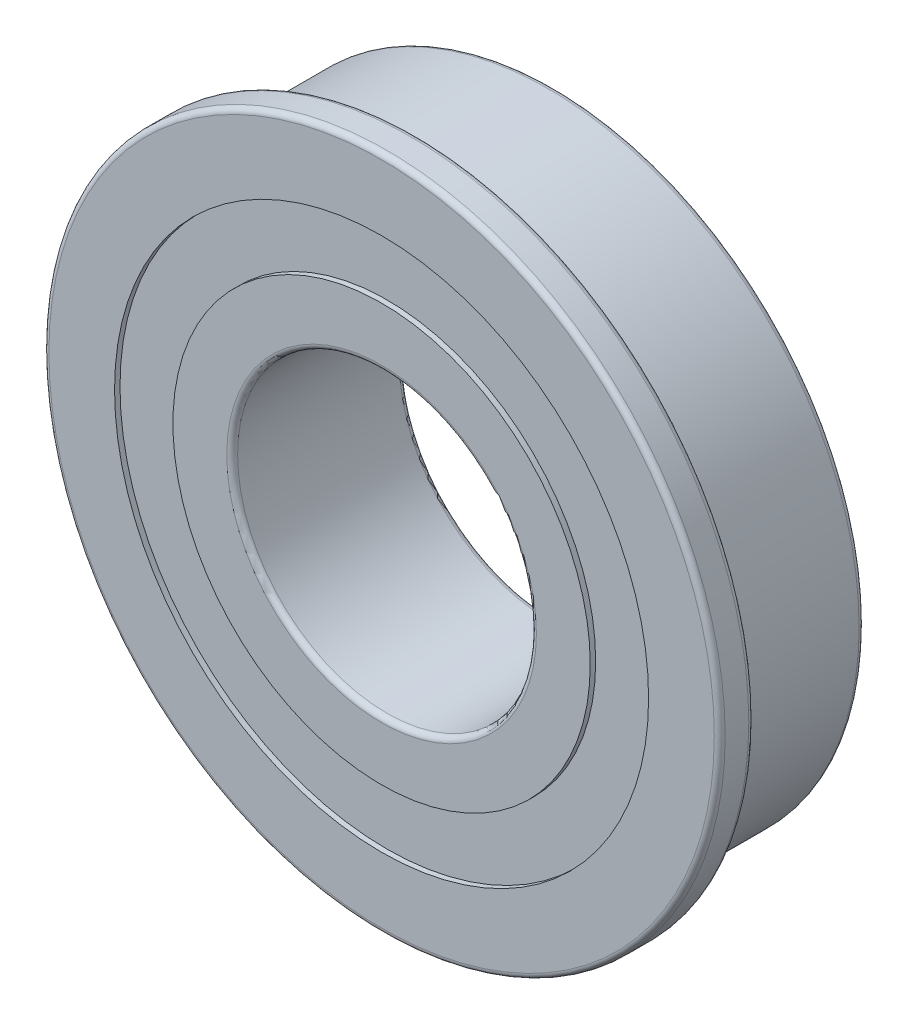
ISO-10303-21;
HEADER;
FILE_DESCRIPTION(('STEP AP214'),'2;1');
FILE_NAME('part.step','',(''),(''),'','','');
FILE_SCHEMA(('AUTOMOTIVE_DESIGN { 1 0 10303 214 1 1 1 1 }'));
ENDSEC;
DATA;
#1=APPLICATION_CONTEXT('core data for automotive mechanical design processes');
#2=APPLICATION_PROTOCOL_DEFINITION('international standard','automotive_design',2000,#1);
#3=PRODUCT_CONTEXT('',#1,'mechanical');
#4=PRODUCT('Part','Part','',(#3));
#5=PRODUCT_RELATED_PRODUCT_CATEGORY('part','',(#4));
#6=PRODUCT_DEFINITION_FORMATION('','',#4);
#7=PRODUCT_DEFINITION_CONTEXT('part definition',#1,'design');
#8=PRODUCT_DEFINITION('design','',#6,#7);
#9=PRODUCT_DEFINITION_SHAPE('','',#8);
#10=(LENGTH_UNIT() NAMED_UNIT(*) SI_UNIT(.MILLI.,.METRE.));
#11=(NAMED_UNIT(*) PLANE_ANGLE_UNIT() SI_UNIT($,.RADIAN.));
#12=(NAMED_UNIT(*) SI_UNIT($,.STERADIAN.) SOLID_ANGLE_UNIT());
#13=UNCERTAINTY_MEASURE_WITH_UNIT(LENGTH_MEASURE(1.E-05),#10,'distance_accuracy_value','');
#14=(GEOMETRIC_REPRESENTATION_CONTEXT(3) GLOBAL_UNCERTAINTY_ASSIGNED_CONTEXT((#13)) GLOBAL_UNIT_ASSIGNED_CONTEXT((#10,
#11,#12)) REPRESENTATION_CONTEXT('',''));
#15=CARTESIAN_POINT('',(0.,0.,0.));
#16=DIRECTION('',(0.,0.,1.));
#17=DIRECTION('',(1.,0.,0.));
#18=AXIS2_PLACEMENT_3D('',#15,#16,#17);
#19=CARTESIAN_POINT('',(0.,0.,53.2489151398028));
#20=DIRECTION('',(0.,0.,1.));
#21=DIRECTION('',(1.,0.,0.));
#22=AXIS2_PLACEMENT_3D('',#19,#20,#21);
#23=CYLINDRICAL_SURFACE('',#22,12.2875000000004);
#24=CARTESIAN_POINT('',(0.,0.,-3.718750000001));
#25=DIRECTION('',(0.,0.,1.));
#26=DIRECTION('',(1.,0.,0.));
#27=AXIS2_PLACEMENT_3D('',#24,#25,#26);
#28=CIRCLE('',#27,12.2875000000004);
#29=CARTESIAN_POINT('',(12.2875000000004,0.,-3.718750000001));
#30=VERTEX_POINT('',#29);
#31=EDGE_CURVE('E83',#30,#30,#28,.T.);
#32=ORIENTED_EDGE('',*,*,#31,.T.);
#33=EDGE_LOOP('',(#32));
#34=FACE_BOUND('',#33,.T.);
#35=CARTESIAN_POINT('',(0.,0.,-3.96875));
#36=DIRECTION('',(0.,0.,1.));
#37=DIRECTION('',(1.,0.,0.));
#38=AXIS2_PLACEMENT_3D('',#35,#36,#37);
#39=CIRCLE('',#38,12.2875000000004);
#40=CARTESIAN_POINT('',(12.2875000000004,0.,-3.96875));
#41=VERTEX_POINT('',#40);
#42=EDGE_CURVE('E247',#41,#41,#39,.F.);
#43=ORIENTED_EDGE('',*,*,#42,.T.);
#44=EDGE_LOOP('',(#43));
#45=FACE_BOUND('',#44,.T.);
#46=ADVANCED_FACE('F19',(#34,#45),#23,.F.);
#47=CARTESIAN_POINT('',(0.,12.2875000000004,-3.96875));
#48=DIRECTION('',(0.,0.,1.));
#49=DIRECTION('',(1.,0.,0.));
#50=AXIS2_PLACEMENT_3D('',#47,#48,#49);
#51=PLANE('',#50);
#52=ORIENTED_EDGE('',*,*,#42,.F.);
#53=EDGE_LOOP('',(#52));
#54=FACE_BOUND('',#53,.T.);
#55=CARTESIAN_POINT('',(0.,0.,-3.96875000000099));
#56=DIRECTION('',(0.,0.,1.));
#57=DIRECTION('',(-1.,0.,0.));
#58=AXIS2_PLACEMENT_3D('',#55,#56,#57);
#59=CIRCLE('',#58,14.037500000001);
#60=CARTESIAN_POINT('',(-14.037500000001,0.,-3.96875000000059));
#61=VERTEX_POINT('',#60);
#62=CARTESIAN_POINT('',(14.037500000001,0.,-3.96875000000059));
#63=VERTEX_POINT('',#62);
#64=EDGE_CURVE('E73',#61,#63,#59,.T.);
#65=ORIENTED_EDGE('',*,*,#64,.F.);
#66=CARTESIAN_POINT('',(0.,0.,-3.96875000000099));
#67=DIRECTION('',(0.,0.,1.));
#68=DIRECTION('',(1.,0.,0.));
#69=AXIS2_PLACEMENT_3D('',#66,#67,#68);
#70=CIRCLE('',#69,14.037500000001);
#71=EDGE_CURVE('E71',#63,#61,#70,.T.);
#72=ORIENTED_EDGE('',*,*,#71,.F.);
#73=EDGE_LOOP('',(#65,#72));
#74=FACE_BOUND('',#73,.T.);
#75=ADVANCED_FACE('F82',(#54,#74),#51,.F.);
#76=CARTESIAN_POINT('',(0.,9.6020000000002,-3.718750000001));
#77=DIRECTION('',(0.,0.,1.));
#78=DIRECTION('',(1.,0.,0.));
#79=AXIS2_PLACEMENT_3D('',#76,#77,#78);
#80=PLANE('',#79);
#81=CARTESIAN_POINT('',(0.,0.,-3.718750000001));
#82=DIRECTION('',(0.,0.,1.));
#83=DIRECTION('',(1.,0.,0.));
#84=AXIS2_PLACEMENT_3D('',#81,#82,#83);
#85=CIRCLE('',#84,9.6020000000002);
#86=CARTESIAN_POINT('',(9.6020000000002,0.,-3.718750000001));
#87=VERTEX_POINT('',#86);
#88=EDGE_CURVE('E78',#87,#87,#85,.F.);
#89=ORIENTED_EDGE('',*,*,#88,.F.);
#90=EDGE_LOOP('',(#89));
#91=FACE_BOUND('',#90,.T.);
#92=ORIENTED_EDGE('',*,*,#31,.F.);
#93=EDGE_LOOP('',(#92));
#94=FACE_BOUND('',#93,.T.);
#95=ADVANCED_FACE('F97',(#91,#94),#80,.F.);
#96=CARTESIAN_POINT('',(0.,0.,-3.718750000001));
#97=DIRECTION('',(0.,0.,1.));
#98=DIRECTION('',(1.,0.,0.));
#99=AXIS2_PLACEMENT_3D('',#96,#97,#98);
#100=TOROIDAL_SURFACE('',#99,14.037500000001,0.249999999999991);
#101=CARTESIAN_POINT('',(0.,0.,-3.718750000001));
#102=DIRECTION('',(0.,0.,1.));
#103=DIRECTION('',(1.,0.,0.));
#104=AXIS2_PLACEMENT_3D('',#101,#102,#103);
#105=CIRCLE('',#104,14.2875);
#106=CARTESIAN_POINT('',(14.2875,0.,-3.718750000001));
#107=VERTEX_POINT('',#106);
#108=EDGE_CURVE('E112',#107,#107,#105,.T.);
#109=ORIENTED_EDGE('',*,*,#108,.F.);
#110=EDGE_LOOP('',(#109));
#111=FACE_BOUND('',#110,.T.);
#112=ORIENTED_EDGE('',*,*,#64,.T.);
#113=ORIENTED_EDGE('',*,*,#71,.T.);
#114=EDGE_LOOP('',(#112,#113));
#115=FACE_BOUND('',#114,.T.);
#116=ADVANCED_FACE('F75',(#111,#115),#100,.T.);
#117=CARTESIAN_POINT('',(0.,0.,53.2489151398028));
#118=DIRECTION('',(0.,0.,1.));
#119=DIRECTION('',(1.,0.,0.));
#120=AXIS2_PLACEMENT_3D('',#117,#118,#119);
#121=CYLINDRICAL_SURFACE('',#120,9.6020000000002);
#122=ORIENTED_EDGE('',*,*,#88,.T.);
#123=EDGE_LOOP('',(#122));
#124=FACE_BOUND('',#123,.T.);
#125=CARTESIAN_POINT('',(0.,0.,-3.96875));
#126=DIRECTION('',(0.,0.,1.));
#127=DIRECTION('',(1.,0.,0.));
#128=AXIS2_PLACEMENT_3D('',#125,#126,#127);
#129=CIRCLE('',#128,9.6020000000002);
#130=CARTESIAN_POINT('',(9.6020000000002,0.,-3.96875));
#131=VERTEX_POINT('',#130);
#132=EDGE_CURVE('E116',#131,#131,#129,.T.);
#133=ORIENTED_EDGE('',*,*,#132,.T.);
#134=EDGE_LOOP('',(#133));
#135=FACE_BOUND('',#134,.T.);
#136=ADVANCED_FACE('F106',(#124,#135),#121,.T.);
#137=CARTESIAN_POINT('',(0.,0.,53.2489151398028));
#138=DIRECTION('',(0.,0.,1.));
#139=DIRECTION('',(1.,0.,0.));
#140=AXIS2_PLACEMENT_3D('',#137,#138,#139);
#141=CYLINDRICAL_SURFACE('',#140,14.2875);
#142=CARTESIAN_POINT('',(0.,0.,1.63125000000045));
#143=DIRECTION('',(0.,0.,-1.));
#144=DIRECTION('',(-1.,0.,0.));
#145=AXIS2_PLACEMENT_3D('',#142,#143,#144);
#146=CIRCLE('',#145,14.2875000000009);
#147=CARTESIAN_POINT('',(-14.2875000000009,0.,1.63125000000045));
#148=VERTEX_POINT('',#147);
#149=EDGE_CURVE('E117',#148,#148,#146,.F.);
#150=ORIENTED_EDGE('',*,*,#149,.F.);
#151=EDGE_LOOP('',(#150));
#152=FACE_BOUND('',#151,.T.);
#153=ORIENTED_EDGE('',*,*,#108,.T.);
#154=EDGE_LOOP('',(#153));
#155=FACE_BOUND('',#154,.T.);
#156=ADVANCED_FACE('F486',(#152,#155),#141,.T.);
#157=CARTESIAN_POINT('',(0.,6.87500000000044,-3.96875));
#158=DIRECTION('',(0.,0.,1.));
#159=DIRECTION('',(1.,0.,0.));
#160=AXIS2_PLACEMENT_3D('',#157,#158,#159);
#161=PLANE('',#160);
#162=CARTESIAN_POINT('',(0.,0.,-3.96875000000099));
#163=DIRECTION('',(0.,0.,-1.));
#164=DIRECTION('',(-1.,0.,0.));
#165=AXIS2_PLACEMENT_3D('',#162,#163,#164);
#166=CIRCLE('',#165,7.12499999999944);
#167=CARTESIAN_POINT('',(-7.12499999999944,0.,-3.96875000000059));
#168=VERTEX_POINT('',#167);
#169=CARTESIAN_POINT('',(7.12499999999944,0.,-3.96875000000059));
#170=VERTEX_POINT('',#169);
#171=EDGE_CURVE('E167',#168,#170,#166,.T.);
#172=ORIENTED_EDGE('',*,*,#171,.F.);
#173=CARTESIAN_POINT('',(0.,0.,-3.96875000000099));
#174=DIRECTION('',(0.,0.,-1.));
#175=DIRECTION('',(1.,0.,0.));
#176=AXIS2_PLACEMENT_3D('',#173,#174,#175);
#177=CIRCLE('',#176,7.12499999999944);
#178=EDGE_CURVE('E218',#170,#168,#177,.T.);
#179=ORIENTED_EDGE('',*,*,#178,.F.);
#180=EDGE_LOOP('',(#172,#179));
#181=FACE_BOUND('',#180,.T.);
#182=ORIENTED_EDGE('',*,*,#132,.F.);
#183=EDGE_LOOP('',(#182));
#184=FACE_BOUND('',#183,.T.);
#185=ADVANCED_FACE('F493',(#181,#184),#161,.F.);
#186=CARTESIAN_POINT('',(0.,0.,1.63125000000045));
#187=DIRECTION('',(0.,0.,-1.));
#188=DIRECTION('',(0.,1.,0.));
#189=AXIS2_PLACEMENT_3D('',#186,#187,#188);
#190=CONICAL_SURFACE('',#189,14.2875000000009,0.5235987755982);
#191=ORIENTED_EDGE('',*,*,#149,.T.);
#192=EDGE_LOOP('',(#191));
#193=FACE_BOUND('',#192,.T.);
#194=CARTESIAN_POINT('',(0.,0.,2.00625000000007));
#195=DIRECTION('',(0.,0.,1.));
#196=DIRECTION('',(1.,0.,0.));
#197=AXIS2_PLACEMENT_3D('',#194,#195,#196);
#198=CIRCLE('',#197,14.0709936490539);
#199=CARTESIAN_POINT('',(14.0709936490539,0.,2.00625000000007));
#200=VERTEX_POINT('',#199);
#201=EDGE_CURVE('E138',#200,#200,#198,.F.);
#202=ORIENTED_EDGE('',*,*,#201,.T.);
#203=EDGE_LOOP('',(#202));
#204=FACE_BOUND('',#203,.T.);
#205=ADVANCED_FACE('F149',(#193,#204),#190,.T.);
#206=CARTESIAN_POINT('',(0.,0.,-3.718750000001));
#207=DIRECTION('',(0.,0.,1.));
#208=DIRECTION('',(1.,0.,0.));
#209=AXIS2_PLACEMENT_3D('',#206,#207,#208);
#210=TOROIDAL_SURFACE('',#209,7.12499999999944,0.249999999999991);
#211=ORIENTED_EDGE('',*,*,#171,.T.);
#212=ORIENTED_EDGE('',*,*,#178,.T.);
#213=EDGE_LOOP('',(#211,#212));
#214=FACE_BOUND('',#213,.T.);
#215=CARTESIAN_POINT('',(0.,0.,-3.718750000001));
#216=DIRECTION('',(0.,0.,1.));
#217=DIRECTION('',(1.,0.,0.));
#218=AXIS2_PLACEMENT_3D('',#215,#216,#217);
#219=CIRCLE('',#218,6.87500000000044);
#220=CARTESIAN_POINT('',(6.87500000000044,0.,-3.718750000001));
#221=VERTEX_POINT('',#220);
#222=EDGE_CURVE('E130',#221,#221,#219,.T.);
#223=ORIENTED_EDGE('',*,*,#222,.T.);
#224=EDGE_LOOP('',(#223));
#225=FACE_BOUND('',#224,.T.);
#226=ADVANCED_FACE('F143',(#214,#225),#210,.T.);
#227=CARTESIAN_POINT('',(0.,0.,53.2489151398028));
#228=DIRECTION('',(0.,0.,1.));
#229=DIRECTION('',(1.,0.,0.));
#230=AXIS2_PLACEMENT_3D('',#227,#228,#229);
#231=CYLINDRICAL_SURFACE('',#230,6.87500000000044);
#232=CARTESIAN_POINT('',(0.,0.,3.718750000001));
#233=DIRECTION('',(0.,0.,-1.));
#234=DIRECTION('',(-1.,0.,0.));
#235=AXIS2_PLACEMENT_3D('',#232,#233,#234);
#236=CIRCLE('',#235,6.87499999999945);
#237=CARTESIAN_POINT('',(-6.87499999999945,0.,3.718750000001));
#238=VERTEX_POINT('',#237);
#239=EDGE_CURVE('E125',#238,#238,#236,.T.);
#240=ORIENTED_EDGE('',*,*,#239,.F.);
#241=EDGE_LOOP('',(#240));
#242=FACE_BOUND('',#241,.T.);
#243=ORIENTED_EDGE('',*,*,#222,.F.);
#244=EDGE_LOOP('',(#243));
#245=FACE_BOUND('',#244,.T.);
#246=ADVANCED_FACE('F148',(#242,#245),#231,.F.);
#247=CARTESIAN_POINT('',(0.,0.,2.13124999999998));
#248=DIRECTION('',(0.,0.,1.));
#249=DIRECTION('',(1.,0.,0.));
#250=AXIS2_PLACEMENT_3D('',#247,#248,#249);
#251=TOROIDAL_SURFACE('',#250,14.2875,0.249999999999991);
#252=ORIENTED_EDGE('',*,*,#201,.F.);
#253=EDGE_LOOP('',(#252));
#254=FACE_BOUND('',#253,.T.);
#255=CARTESIAN_POINT('',(0.,0.,2.38124999999997));
#256=DIRECTION('',(0.,0.,-1.));
#257=DIRECTION('',(1.,0.,0.));
#258=AXIS2_PLACEMENT_3D('',#255,#256,#257);
#259=CIRCLE('',#258,14.2875);
#260=CARTESIAN_POINT('',(14.2875,0.,2.38124999999998));
#261=VERTEX_POINT('',#260);
#262=CARTESIAN_POINT('',(-14.2875,0.,2.38124999999998));
#263=VERTEX_POINT('',#262);
#264=EDGE_CURVE('E197',#261,#263,#259,.T.);
#265=ORIENTED_EDGE('',*,*,#264,.T.);
#266=CARTESIAN_POINT('',(0.,0.,2.38124999999997));
#267=DIRECTION('',(0.,0.,-1.));
#268=DIRECTION('',(-1.,0.,0.));
#269=AXIS2_PLACEMENT_3D('',#266,#267,#268);
#270=CIRCLE('',#269,14.2875);
#271=EDGE_CURVE('E129',#263,#261,#270,.T.);
#272=ORIENTED_EDGE('',*,*,#271,.T.);
#273=EDGE_LOOP('',(#265,#272));
#274=FACE_BOUND('',#273,.T.);
#275=ADVANCED_FACE('F174',(#254,#274),#251,.F.);
#276=CARTESIAN_POINT('',(0.,0.,3.718750000001));
#277=DIRECTION('',(0.,0.,-1.));
#278=DIRECTION('',(-1.,0.,0.));
#279=AXIS2_PLACEMENT_3D('',#276,#277,#278);
#280=TOROIDAL_SURFACE('',#279,7.12499999999944,0.249999999999991);
#281=CARTESIAN_POINT('',(0.,0.,3.96875000000099));
#282=DIRECTION('',(0.,0.,1.));
#283=DIRECTION('',(1.,0.,0.));
#284=AXIS2_PLACEMENT_3D('',#281,#282,#283);
#285=CIRCLE('',#284,7.12499999999944);
#286=CARTESIAN_POINT('',(7.12499999999944,0.,3.96875000000059));
#287=VERTEX_POINT('',#286);
#288=CARTESIAN_POINT('',(-7.12499999999944,0.,3.96875000000059));
#289=VERTEX_POINT('',#288);
#290=EDGE_CURVE('E200',#287,#289,#285,.T.);
#291=ORIENTED_EDGE('',*,*,#290,.T.);
#292=CARTESIAN_POINT('',(0.,0.,3.96875000000099));
#293=DIRECTION('',(0.,0.,1.));
#294=DIRECTION('',(-1.,0.,0.));
#295=AXIS2_PLACEMENT_3D('',#292,#293,#294);
#296=CIRCLE('',#295,7.12499999999944);
#297=EDGE_CURVE('E203',#289,#287,#296,.T.);
#298=ORIENTED_EDGE('',*,*,#297,.T.);
#299=EDGE_LOOP('',(#291,#298));
#300=FACE_BOUND('',#299,.T.);
#301=ORIENTED_EDGE('',*,*,#239,.T.);
#302=EDGE_LOOP('',(#301));
#303=FACE_BOUND('',#302,.T.);
#304=ADVANCED_FACE('F184',(#300,#303),#280,.T.);
#305=CARTESIAN_POINT('',(0.,14.2875,2.38125));
#306=DIRECTION('',(0.,0.,1.));
#307=DIRECTION('',(1.,0.,0.));
#308=AXIS2_PLACEMENT_3D('',#305,#306,#307);
#309=PLANE('',#308);
#310=ORIENTED_EDGE('',*,*,#271,.F.);
#311=ORIENTED_EDGE('',*,*,#264,.F.);
#312=EDGE_LOOP('',(#310,#311));
#313=FACE_BOUND('',#312,.T.);
#314=CARTESIAN_POINT('',(0.,0.,2.38124999999901));
#315=DIRECTION('',(0.,0.,1.));
#316=DIRECTION('',(-1.,0.,0.));
#317=AXIS2_PLACEMENT_3D('',#314,#315,#316);
#318=CIRCLE('',#317,15.3099999999997);
#319=CARTESIAN_POINT('',(-15.3099999999997,0.,2.38124999999941));
#320=VERTEX_POINT('',#319);
#321=CARTESIAN_POINT('',(15.3099999999997,0.,2.38124999999941));
#322=VERTEX_POINT('',#321);
#323=EDGE_CURVE('E347',#320,#322,#318,.T.);
#324=ORIENTED_EDGE('',*,*,#323,.F.);
#325=CARTESIAN_POINT('',(0.,0.,2.38124999999901));
#326=DIRECTION('',(0.,0.,1.));
#327=DIRECTION('',(1.,0.,0.));
#328=AXIS2_PLACEMENT_3D('',#325,#326,#327);
#329=CIRCLE('',#328,15.3099999999997);
#330=EDGE_CURVE('E384',#322,#320,#329,.T.);
#331=ORIENTED_EDGE('',*,*,#330,.F.);
#332=EDGE_LOOP('',(#324,#331));
#333=FACE_BOUND('',#332,.T.);
#334=ADVANCED_FACE('F353',(#313,#333),#309,.F.);
#335=CARTESIAN_POINT('',(0.,9.6020000000002,3.96875));
#336=DIRECTION('',(0.,0.,-1.));
#337=DIRECTION('',(-1.,0.,0.));
#338=AXIS2_PLACEMENT_3D('',#335,#336,#337);
#339=PLANE('',#338);
#340=ORIENTED_EDGE('',*,*,#290,.F.);
#341=ORIENTED_EDGE('',*,*,#297,.F.);
#342=EDGE_LOOP('',(#340,#341));
#343=FACE_BOUND('',#342,.T.);
#344=CARTESIAN_POINT('',(0.,0.,3.96875));
#345=DIRECTION('',(0.,0.,1.));
#346=DIRECTION('',(1.,0.,0.));
#347=AXIS2_PLACEMENT_3D('',#344,#345,#346);
#348=CIRCLE('',#347,9.6020000000002);
#349=CARTESIAN_POINT('',(9.6020000000002,0.,3.96875));
#350=VERTEX_POINT('',#349);
#351=EDGE_CURVE('E215',#350,#350,#348,.F.);
#352=ORIENTED_EDGE('',*,*,#351,.F.);
#353=EDGE_LOOP('',(#352));
#354=FACE_BOUND('',#353,.T.);
#355=ADVANCED_FACE('F298',(#343,#354),#339,.F.);
#356=CARTESIAN_POINT('',(0.,0.,2.631249999999));
#357=DIRECTION('',(0.,0.,1.));
#358=DIRECTION('',(1.,0.,0.));
#359=AXIS2_PLACEMENT_3D('',#356,#357,#358);
#360=TOROIDAL_SURFACE('',#359,15.3099999999997,0.249999999999991);
#361=CARTESIAN_POINT('',(0.,0.,2.631249999999));
#362=DIRECTION('',(0.,0.,1.));
#363=DIRECTION('',(1.,0.,0.));
#364=AXIS2_PLACEMENT_3D('',#361,#362,#363);
#365=CIRCLE('',#364,15.5600000000013);
#366=CARTESIAN_POINT('',(15.5600000000013,0.,2.631249999999));
#367=VERTEX_POINT('',#366);
#368=EDGE_CURVE('E211',#367,#367,#365,.T.);
#369=ORIENTED_EDGE('',*,*,#368,.F.);
#370=EDGE_LOOP('',(#369));
#371=FACE_BOUND('',#370,.T.);
#372=ORIENTED_EDGE('',*,*,#330,.T.);
#373=ORIENTED_EDGE('',*,*,#323,.T.);
#374=EDGE_LOOP('',(#372,#373));
#375=FACE_BOUND('',#374,.T.);
#376=ADVANCED_FACE('F292',(#371,#375),#360,.T.);
#377=CARTESIAN_POINT('',(0.,0.,53.2489151398028));
#378=DIRECTION('',(0.,0.,1.));
#379=DIRECTION('',(1.,0.,0.));
#380=AXIS2_PLACEMENT_3D('',#377,#378,#379);
#381=CYLINDRICAL_SURFACE('',#380,9.6020000000002);
#382=ORIENTED_EDGE('',*,*,#351,.T.);
#383=EDGE_LOOP('',(#382));
#384=FACE_BOUND('',#383,.T.);
#385=CARTESIAN_POINT('',(0.,0.,3.718750000001));
#386=DIRECTION('',(0.,0.,1.));
#387=DIRECTION('',(1.,0.,0.));
#388=AXIS2_PLACEMENT_3D('',#385,#386,#387);
#389=CIRCLE('',#388,9.6020000000002);
#390=CARTESIAN_POINT('',(9.6020000000002,0.,3.718750000001));
#391=VERTEX_POINT('',#390);
#392=EDGE_CURVE('E214',#391,#391,#389,.T.);
#393=ORIENTED_EDGE('',*,*,#392,.T.);
#394=EDGE_LOOP('',(#393));
#395=FACE_BOUND('',#394,.T.);
#396=ADVANCED_FACE('F297',(#384,#395),#381,.T.);
#397=CARTESIAN_POINT('',(0.,0.,53.2489151398028));
#398=DIRECTION('',(0.,0.,1.));
#399=DIRECTION('',(1.,0.,0.));
#400=AXIS2_PLACEMENT_3D('',#397,#398,#399);
#401=CYLINDRICAL_SURFACE('',#400,15.5600000000013);
#402=CARTESIAN_POINT('',(0.,0.,3.718750000001));
#403=DIRECTION('',(0.,0.,-1.));
#404=DIRECTION('',(-1.,0.,0.));
#405=AXIS2_PLACEMENT_3D('',#402,#403,#404);
#406=CIRCLE('',#405,15.5599999999997);
#407=CARTESIAN_POINT('',(-15.5599999999997,0.,3.718750000001));
#408=VERTEX_POINT('',#407);
#409=EDGE_CURVE('E221',#408,#408,#406,.F.);
#410=ORIENTED_EDGE('',*,*,#409,.F.);
#411=EDGE_LOOP('',(#410));
#412=FACE_BOUND('',#411,.T.);
#413=ORIENTED_EDGE('',*,*,#368,.T.);
#414=EDGE_LOOP('',(#413));
#415=FACE_BOUND('',#414,.T.);
#416=ADVANCED_FACE('F429',(#412,#415),#401,.T.);
#417=CARTESIAN_POINT('',(0.,12.2875000000004,3.718750000001));
#418=DIRECTION('',(0.,0.,-1.));
#419=DIRECTION('',(-1.,0.,0.));
#420=AXIS2_PLACEMENT_3D('',#417,#418,#419);
#421=PLANE('',#420);
#422=ORIENTED_EDGE('',*,*,#392,.F.);
#423=EDGE_LOOP('',(#422));
#424=FACE_BOUND('',#423,.T.);
#425=CARTESIAN_POINT('',(0.,0.,3.718750000001));
#426=DIRECTION('',(0.,0.,1.));
#427=DIRECTION('',(1.,0.,0.));
#428=AXIS2_PLACEMENT_3D('',#425,#426,#427);
#429=CIRCLE('',#428,12.2875000000004);
#430=CARTESIAN_POINT('',(12.2875000000004,0.,3.718750000001));
#431=VERTEX_POINT('',#430);
#432=EDGE_CURVE('E224',#431,#431,#429,.T.);
#433=ORIENTED_EDGE('',*,*,#432,.T.);
#434=EDGE_LOOP('',(#433));
#435=FACE_BOUND('',#434,.T.);
#436=ADVANCED_FACE('F269',(#424,#435),#421,.F.);
#437=CARTESIAN_POINT('',(0.,0.,3.718750000001));
#438=DIRECTION('',(0.,0.,-1.));
#439=DIRECTION('',(-1.,0.,0.));
#440=AXIS2_PLACEMENT_3D('',#437,#438,#439);
#441=TOROIDAL_SURFACE('',#440,15.3099999999997,0.249999999999991);
#442=ORIENTED_EDGE('',*,*,#409,.T.);
#443=EDGE_LOOP('',(#442));
#444=FACE_BOUND('',#443,.T.);
#445=CARTESIAN_POINT('',(0.,0.,3.96875000000099));
#446=DIRECTION('',(0.,0.,-1.));
#447=DIRECTION('',(-1.,0.,0.));
#448=AXIS2_PLACEMENT_3D('',#445,#446,#447);
#449=CIRCLE('',#448,15.3099999999997);
#450=CARTESIAN_POINT('',(-15.3099999999997,0.,3.96875000000059));
#451=VERTEX_POINT('',#450);
#452=CARTESIAN_POINT('',(15.3099999999997,0.,3.96875000000059));
#453=VERTEX_POINT('',#452);
#454=EDGE_CURVE('E31',#451,#453,#449,.T.);
#455=ORIENTED_EDGE('',*,*,#454,.T.);
#456=CARTESIAN_POINT('',(0.,0.,3.96875000000099));
#457=DIRECTION('',(0.,0.,-1.));
#458=DIRECTION('',(1.,0.,0.));
#459=AXIS2_PLACEMENT_3D('',#456,#457,#458);
#460=CIRCLE('',#459,15.3099999999997);
#461=EDGE_CURVE('E220',#453,#451,#460,.T.);
#462=ORIENTED_EDGE('',*,*,#461,.T.);
#463=EDGE_LOOP('',(#455,#462));
#464=FACE_BOUND('',#463,.T.);
#465=ADVANCED_FACE('F257',(#444,#464),#441,.T.);
#466=CARTESIAN_POINT('',(0.,0.,53.2489151398028));
#467=DIRECTION('',(0.,0.,1.));
#468=DIRECTION('',(1.,0.,0.));
#469=AXIS2_PLACEMENT_3D('',#466,#467,#468);
#470=CYLINDRICAL_SURFACE('',#469,12.2875000000004);
#471=CARTESIAN_POINT('',(0.,0.,3.96875));
#472=DIRECTION('',(0.,0.,1.));
#473=DIRECTION('',(1.,0.,0.));
#474=AXIS2_PLACEMENT_3D('',#471,#472,#473);
#475=CIRCLE('',#474,12.2875000000004);
#476=CARTESIAN_POINT('',(12.2875000000004,0.,3.96875));
#477=VERTEX_POINT('',#476);
#478=EDGE_CURVE('E12',#477,#477,#475,.T.);
#479=ORIENTED_EDGE('',*,*,#478,.T.);
#480=EDGE_LOOP('',(#479));
#481=FACE_BOUND('',#480,.T.);
#482=ORIENTED_EDGE('',*,*,#432,.F.);
#483=EDGE_LOOP('',(#482));
#484=FACE_BOUND('',#483,.T.);
#485=ADVANCED_FACE('F268',(#481,#484),#470,.F.);
#486=CARTESIAN_POINT('',(0.,15.5600000000013,3.96875));
#487=DIRECTION('',(0.,0.,-1.));
#488=DIRECTION('',(-1.,0.,0.));
#489=AXIS2_PLACEMENT_3D('',#486,#487,#488);
#490=PLANE('',#489);
#491=ORIENTED_EDGE('',*,*,#478,.F.);
#492=EDGE_LOOP('',(#491));
#493=FACE_BOUND('',#492,.T.);
#494=ORIENTED_EDGE('',*,*,#461,.F.);
#495=ORIENTED_EDGE('',*,*,#454,.F.);
#496=EDGE_LOOP('',(#494,#495));
#497=FACE_BOUND('',#496,.T.);
#498=ADVANCED_FACE('F393',(#493,#497),#490,.F.);
#499=CLOSED_SHELL('',(#46,#75,#95,#116,#136,#156,#185,#205,#226,#246,#275,#304,#334,#355,#376,
#396,#416,#436,#465,#485,#498));
#500=MANIFOLD_SOLID_BREP('B1',#499);
#501=ADVANCED_BREP_SHAPE_REPRESENTATION('',(#18,#500),#14);
#502=SHAPE_DEFINITION_REPRESENTATION(#9,#501);
ENDSEC;
END-ISO-10303-21;
